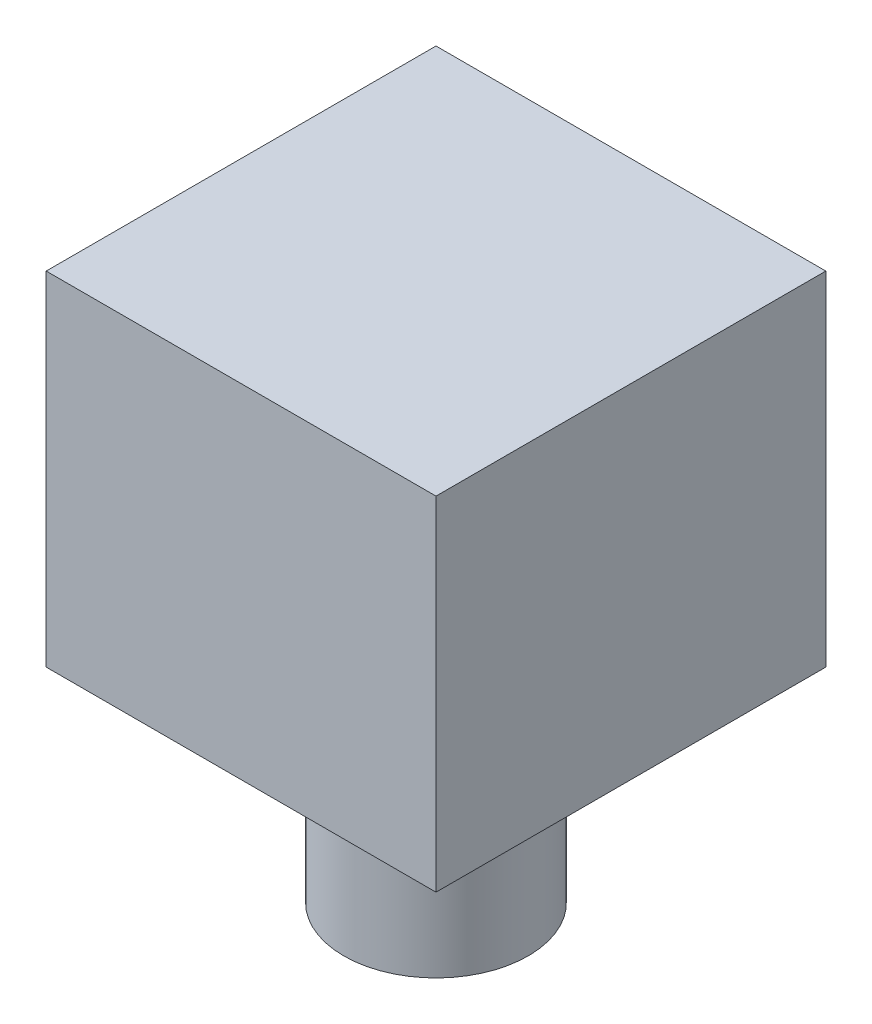
ISO-10303-21;
HEADER;
FILE_DESCRIPTION(('STEP AP214'),'2;1');
FILE_NAME('part.step','',(''),(''),'','','');
FILE_SCHEMA(('AUTOMOTIVE_DESIGN { 1 0 10303 214 1 1 1 1 }'));
ENDSEC;
DATA;
#1=APPLICATION_CONTEXT('core data for automotive mechanical design processes');
#2=APPLICATION_PROTOCOL_DEFINITION('international standard','automotive_design',2000,#1);
#3=PRODUCT_CONTEXT('',#1,'mechanical');
#4=PRODUCT('Part','Part','',(#3));
#5=PRODUCT_RELATED_PRODUCT_CATEGORY('part','',(#4));
#6=PRODUCT_DEFINITION_FORMATION('','',#4);
#7=PRODUCT_DEFINITION_CONTEXT('part definition',#1,'design');
#8=PRODUCT_DEFINITION('design','',#6,#7);
#9=PRODUCT_DEFINITION_SHAPE('','',#8);
#10=(LENGTH_UNIT() NAMED_UNIT(*) SI_UNIT(.MILLI.,.METRE.));
#11=(NAMED_UNIT(*) PLANE_ANGLE_UNIT() SI_UNIT($,.RADIAN.));
#12=(NAMED_UNIT(*) SI_UNIT($,.STERADIAN.) SOLID_ANGLE_UNIT());
#13=UNCERTAINTY_MEASURE_WITH_UNIT(LENGTH_MEASURE(1.E-05),#10,'distance_accuracy_value','');
#14=(GEOMETRIC_REPRESENTATION_CONTEXT(3) GLOBAL_UNCERTAINTY_ASSIGNED_CONTEXT((#13)) GLOBAL_UNIT_ASSIGNED_CONTEXT((#10,
#11,#12)) REPRESENTATION_CONTEXT('',''));
#15=CARTESIAN_POINT('',(0.,0.,0.));
#16=DIRECTION('',(0.,0.,1.));
#17=DIRECTION('',(1.,0.,0.));
#18=AXIS2_PLACEMENT_3D('',#15,#16,#17);
#19=CARTESIAN_POINT('',(0.,39.878,0.));
#20=DIRECTION('',(0.,-1.,0.));
#21=DIRECTION('',(0.,0.,-1.));
#22=AXIS2_PLACEMENT_3D('',#19,#20,#21);
#23=CYLINDRICAL_SURFACE('',#22,18.034);
#24=CARTESIAN_POINT('',(0.,39.878,0.));
#25=DIRECTION('',(0.,1.,0.));
#26=DIRECTION('',(0.,0.,1.));
#27=AXIS2_PLACEMENT_3D('',#24,#25,#26);
#28=CIRCLE('',#27,18.034);
#29=CARTESIAN_POINT('',(0.,39.878,18.034));
#30=VERTEX_POINT('',#29);
#31=EDGE_CURVE('E11',#30,#30,#28,.T.);
#32=ORIENTED_EDGE('',*,*,#31,.F.);
#33=EDGE_LOOP('',(#32));
#34=FACE_BOUND('',#33,.T.);
#35=CARTESIAN_POINT('',(0.,0.,0.));
#36=DIRECTION('',(0.,1.,0.));
#37=DIRECTION('',(0.,0.,1.));
#38=AXIS2_PLACEMENT_3D('',#35,#36,#37);
#39=CIRCLE('',#38,18.034);
#40=CARTESIAN_POINT('',(0.,0.,18.034));
#41=VERTEX_POINT('',#40);
#42=EDGE_CURVE('E35',#41,#41,#39,.T.);
#43=ORIENTED_EDGE('',*,*,#42,.T.);
#44=EDGE_LOOP('',(#43));
#45=FACE_BOUND('',#44,.T.);
#46=ADVANCED_FACE('F32',(#34,#45),#23,.T.);
#47=CARTESIAN_POINT('',(0.,0.,0.));
#48=DIRECTION('',(0.,1.,0.));
#49=DIRECTION('',(0.,0.,1.));
#50=AXIS2_PLACEMENT_3D('',#47,#48,#49);
#51=PLANE('',#50);
#52=ORIENTED_EDGE('',*,*,#42,.F.);
#53=EDGE_LOOP('',(#52));
#54=FACE_BOUND('',#53,.T.);
#55=ADVANCED_FACE('F111',(#54),#51,.F.);
#56=CARTESIAN_POINT('',(0.,39.878,0.));
#57=DIRECTION('',(0.,-1.,0.));
#58=DIRECTION('',(0.,0.,-1.));
#59=AXIS2_PLACEMENT_3D('',#56,#57,#58);
#60=PLANE('',#59);
#61=DIRECTION('',(0.,0.,-1.));
#62=VECTOR('',#61,1.);
#63=CARTESIAN_POINT('',(38.1,39.878,38.1));
#64=LINE('',#63,#62);
#65=CARTESIAN_POINT('',(38.1,39.878,38.1));
#66=VERTEX_POINT('',#65);
#67=CARTESIAN_POINT('',(38.1,39.878,-38.1));
#68=VERTEX_POINT('',#67);
#69=EDGE_CURVE('E99',#66,#68,#64,.T.);
#70=ORIENTED_EDGE('',*,*,#69,.F.);
#71=DIRECTION('',(1.,0.,0.));
#72=VECTOR('',#71,1.);
#73=CARTESIAN_POINT('',(-38.1,39.878,38.1));
#74=LINE('',#73,#72);
#75=CARTESIAN_POINT('',(-38.1,39.878,38.1));
#76=VERTEX_POINT('',#75);
#77=EDGE_CURVE('E71',#76,#66,#74,.T.);
#78=ORIENTED_EDGE('',*,*,#77,.F.);
#79=DIRECTION('',(0.,0.,1.));
#80=VECTOR('',#79,1.);
#81=CARTESIAN_POINT('',(-38.1,39.878,38.1));
#82=LINE('',#81,#80);
#83=CARTESIAN_POINT('',(-38.1,39.878,-38.1));
#84=VERTEX_POINT('',#83);
#85=EDGE_CURVE('E65',#84,#76,#82,.T.);
#86=ORIENTED_EDGE('',*,*,#85,.F.);
#87=DIRECTION('',(-1.,0.,0.));
#88=VECTOR('',#87,1.);
#89=CARTESIAN_POINT('',(-38.1,39.878,-38.1));
#90=LINE('',#89,#88);
#91=EDGE_CURVE('E89',#68,#84,#90,.T.);
#92=ORIENTED_EDGE('',*,*,#91,.F.);
#93=EDGE_LOOP('',(#70,#78,#86,#92));
#94=FACE_BOUND('',#93,.T.);
#95=ORIENTED_EDGE('',*,*,#31,.T.);
#96=EDGE_LOOP('',(#95));
#97=FACE_BOUND('',#96,.T.);
#98=ADVANCED_FACE('F113',(#94,#97),#60,.T.);
#99=CARTESIAN_POINT('',(38.1,106.934,38.1));
#100=DIRECTION('',(-1.,0.,0.));
#101=DIRECTION('',(0.,0.,1.));
#102=AXIS2_PLACEMENT_3D('',#99,#100,#101);
#103=PLANE('',#102);
#104=ORIENTED_EDGE('',*,*,#69,.T.);
#105=DIRECTION('',(0.,-1.,0.));
#106=VECTOR('',#105,1.);
#107=CARTESIAN_POINT('',(38.1,106.934,-38.1));
#108=LINE('',#107,#106);
#109=CARTESIAN_POINT('',(38.1,106.934,-38.1));
#110=VERTEX_POINT('',#109);
#111=EDGE_CURVE('E90',#110,#68,#108,.T.);
#112=ORIENTED_EDGE('',*,*,#111,.F.);
#113=DIRECTION('',(0.,0.,-1.));
#114=VECTOR('',#113,1.);
#115=CARTESIAN_POINT('',(38.1,106.934,38.1));
#116=LINE('',#115,#114);
#117=CARTESIAN_POINT('',(38.1,106.934,38.1));
#118=VERTEX_POINT('',#117);
#119=EDGE_CURVE('E84',#118,#110,#116,.T.);
#120=ORIENTED_EDGE('',*,*,#119,.F.);
#121=DIRECTION('',(0.,-1.,0.));
#122=VECTOR('',#121,1.);
#123=CARTESIAN_POINT('',(38.1,106.934,38.1));
#124=LINE('',#123,#122);
#125=EDGE_CURVE('E95',#118,#66,#124,.T.);
#126=ORIENTED_EDGE('',*,*,#125,.T.);
#127=EDGE_LOOP('',(#104,#112,#120,#126));
#128=FACE_BOUND('',#127,.T.);
#129=ADVANCED_FACE('F118',(#128),#103,.F.);
#130=CARTESIAN_POINT('',(-38.1,106.934,-38.1));
#131=DIRECTION('',(0.,0.,1.));
#132=DIRECTION('',(1.,0.,0.));
#133=AXIS2_PLACEMENT_3D('',#130,#131,#132);
#134=PLANE('',#133);
#135=ORIENTED_EDGE('',*,*,#91,.T.);
#136=DIRECTION('',(0.,-1.,0.));
#137=VECTOR('',#136,1.);
#138=CARTESIAN_POINT('',(-38.1,106.934,-38.1));
#139=LINE('',#138,#137);
#140=CARTESIAN_POINT('',(-38.1,106.934,-38.1));
#141=VERTEX_POINT('',#140);
#142=EDGE_CURVE('E87',#141,#84,#139,.T.);
#143=ORIENTED_EDGE('',*,*,#142,.F.);
#144=DIRECTION('',(-1.,0.,0.));
#145=VECTOR('',#144,1.);
#146=CARTESIAN_POINT('',(-38.1,106.934,-38.1));
#147=LINE('',#146,#145);
#148=EDGE_CURVE('E79',#110,#141,#147,.T.);
#149=ORIENTED_EDGE('',*,*,#148,.F.);
#150=ORIENTED_EDGE('',*,*,#111,.T.);
#151=EDGE_LOOP('',(#135,#143,#149,#150));
#152=FACE_BOUND('',#151,.T.);
#153=ADVANCED_FACE('F88',(#152),#134,.F.);
#154=CARTESIAN_POINT('',(-38.1,106.934,38.1));
#155=DIRECTION('',(1.,0.,0.));
#156=DIRECTION('',(0.,0.,-1.));
#157=AXIS2_PLACEMENT_3D('',#154,#155,#156);
#158=PLANE('',#157);
#159=ORIENTED_EDGE('',*,*,#85,.T.);
#160=DIRECTION('',(0.,-1.,0.));
#161=VECTOR('',#160,1.);
#162=CARTESIAN_POINT('',(-38.1,106.934,38.1));
#163=LINE('',#162,#161);
#164=CARTESIAN_POINT('',(-38.1,106.934,38.1));
#165=VERTEX_POINT('',#164);
#166=EDGE_CURVE('E91',#165,#76,#163,.T.);
#167=ORIENTED_EDGE('',*,*,#166,.F.);
#168=DIRECTION('',(0.,0.,1.));
#169=VECTOR('',#168,1.);
#170=CARTESIAN_POINT('',(-38.1,106.934,38.1));
#171=LINE('',#170,#169);
#172=EDGE_CURVE('E82',#141,#165,#171,.T.);
#173=ORIENTED_EDGE('',*,*,#172,.F.);
#174=ORIENTED_EDGE('',*,*,#142,.T.);
#175=EDGE_LOOP('',(#159,#167,#173,#174));
#176=FACE_BOUND('',#175,.T.);
#177=ADVANCED_FACE('F93',(#176),#158,.F.);
#178=CARTESIAN_POINT('',(-38.1,106.934,38.1));
#179=DIRECTION('',(0.,0.,-1.));
#180=DIRECTION('',(-1.,0.,0.));
#181=AXIS2_PLACEMENT_3D('',#178,#179,#180);
#182=PLANE('',#181);
#183=ORIENTED_EDGE('',*,*,#77,.T.);
#184=ORIENTED_EDGE('',*,*,#125,.F.);
#185=DIRECTION('',(1.,0.,0.));
#186=VECTOR('',#185,1.);
#187=CARTESIAN_POINT('',(-38.1,106.934,38.1));
#188=LINE('',#187,#186);
#189=EDGE_CURVE('E48',#165,#118,#188,.T.);
#190=ORIENTED_EDGE('',*,*,#189,.F.);
#191=ORIENTED_EDGE('',*,*,#166,.T.);
#192=EDGE_LOOP('',(#183,#184,#190,#191));
#193=FACE_BOUND('',#192,.T.);
#194=ADVANCED_FACE('F130',(#193),#182,.F.);
#195=CARTESIAN_POINT('',(0.,106.934,0.));
#196=DIRECTION('',(0.,-1.,0.));
#197=DIRECTION('',(0.,0.,-1.));
#198=AXIS2_PLACEMENT_3D('',#195,#196,#197);
#199=PLANE('',#198);
#200=ORIENTED_EDGE('',*,*,#119,.T.);
#201=ORIENTED_EDGE('',*,*,#148,.T.);
#202=ORIENTED_EDGE('',*,*,#172,.T.);
#203=ORIENTED_EDGE('',*,*,#189,.T.);
#204=EDGE_LOOP('',(#200,#201,#202,#203));
#205=FACE_BOUND('',#204,.T.);
#206=ADVANCED_FACE('F80',(#205),#199,.F.);
#207=CLOSED_SHELL('',(#46,#55,#98,#129,#153,#177,#194,#206));
#208=MANIFOLD_SOLID_BREP('B2',#207);
#209=ADVANCED_BREP_SHAPE_REPRESENTATION('',(#18,#208),#14);
#210=SHAPE_DEFINITION_REPRESENTATION(#9,#209);
ENDSEC;
END-ISO-10303-21;
